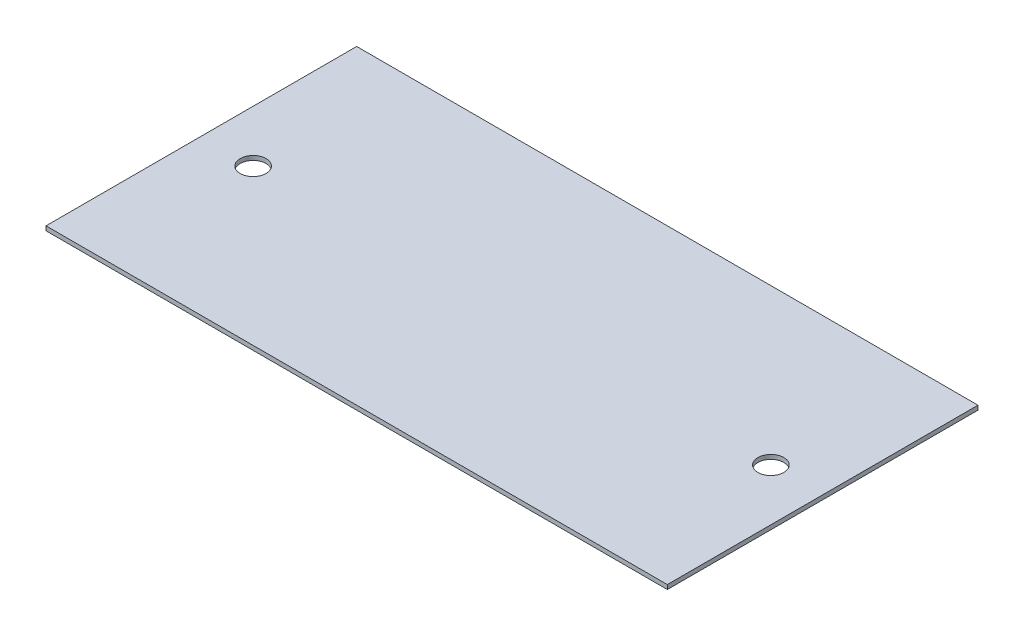
ISO-10303-21;
HEADER;
FILE_DESCRIPTION(('STEP AP214'),'2;1');
FILE_NAME('part.step','',(''),(''),'','','');
FILE_SCHEMA(('AUTOMOTIVE_DESIGN { 1 0 10303 214 1 1 1 1 }'));
ENDSEC;
DATA;
#1=APPLICATION_CONTEXT('core data for automotive mechanical design processes');
#2=APPLICATION_PROTOCOL_DEFINITION('international standard','automotive_design',2000,#1);
#3=PRODUCT_CONTEXT('',#1,'mechanical');
#4=PRODUCT('Part','Part','',(#3));
#5=PRODUCT_RELATED_PRODUCT_CATEGORY('part','',(#4));
#6=PRODUCT_DEFINITION_FORMATION('','',#4);
#7=PRODUCT_DEFINITION_CONTEXT('part definition',#1,'design');
#8=PRODUCT_DEFINITION('design','',#6,#7);
#9=PRODUCT_DEFINITION_SHAPE('','',#8);
#10=(LENGTH_UNIT() NAMED_UNIT(*) SI_UNIT(.MILLI.,.METRE.));
#11=(NAMED_UNIT(*) PLANE_ANGLE_UNIT() SI_UNIT($,.RADIAN.));
#12=(NAMED_UNIT(*) SI_UNIT($,.STERADIAN.) SOLID_ANGLE_UNIT());
#13=UNCERTAINTY_MEASURE_WITH_UNIT(LENGTH_MEASURE(1.E-05),#10,'distance_accuracy_value','');
#14=(GEOMETRIC_REPRESENTATION_CONTEXT(3) GLOBAL_UNCERTAINTY_ASSIGNED_CONTEXT((#13)) GLOBAL_UNIT_ASSIGNED_CONTEXT((#10,
#11,#12)) REPRESENTATION_CONTEXT('',''));
#15=CARTESIAN_POINT('',(0.,0.,0.));
#16=DIRECTION('',(0.,0.,1.));
#17=DIRECTION('',(1.,0.,0.));
#18=AXIS2_PLACEMENT_3D('',#15,#16,#17);
#19=CARTESIAN_POINT('',(914.4,6.35,0.));
#20=DIRECTION('',(-1.,0.,0.));
#21=DIRECTION('',(0.,0.,1.));
#22=AXIS2_PLACEMENT_3D('',#19,#20,#21);
#23=PLANE('',#22);
#24=DIRECTION('',(0.,0.,-1.));
#25=VECTOR('',#24,1.);
#26=CARTESIAN_POINT('',(914.4,0.,0.));
#27=LINE('',#26,#25);
#28=CARTESIAN_POINT('',(914.4,0.,0.));
#29=VERTEX_POINT('',#28);
#30=CARTESIAN_POINT('',(914.4,0.,-457.2));
#31=VERTEX_POINT('',#30);
#32=EDGE_CURVE('E96',#29,#31,#27,.T.);
#33=ORIENTED_EDGE('',*,*,#32,.T.);
#34=DIRECTION('',(0.,-1.,0.));
#35=VECTOR('',#34,1.);
#36=CARTESIAN_POINT('',(914.4,6.35,-457.2));
#37=LINE('',#36,#35);
#38=CARTESIAN_POINT('',(914.4,6.35,-457.2));
#39=VERTEX_POINT('',#38);
#40=EDGE_CURVE('E11',#39,#31,#37,.T.);
#41=ORIENTED_EDGE('',*,*,#40,.F.);
#42=DIRECTION('',(0.,0.,-1.));
#43=VECTOR('',#42,1.);
#44=CARTESIAN_POINT('',(914.4,6.35,0.));
#45=LINE('',#44,#43);
#46=CARTESIAN_POINT('',(914.4,6.35,0.));
#47=VERTEX_POINT('',#46);
#48=EDGE_CURVE('E84',#47,#39,#45,.T.);
#49=ORIENTED_EDGE('',*,*,#48,.F.);
#50=DIRECTION('',(0.,-1.,0.));
#51=VECTOR('',#50,1.);
#52=CARTESIAN_POINT('',(914.4,6.35,0.));
#53=LINE('',#52,#51);
#54=EDGE_CURVE('E92',#47,#29,#53,.T.);
#55=ORIENTED_EDGE('',*,*,#54,.T.);
#56=EDGE_LOOP('',(#33,#41,#49,#55));
#57=FACE_BOUND('',#56,.T.);
#58=ADVANCED_FACE('F33',(#57),#23,.F.);
#59=CARTESIAN_POINT('',(0.,6.35,-457.2));
#60=DIRECTION('',(0.,0.,1.));
#61=DIRECTION('',(1.,0.,0.));
#62=AXIS2_PLACEMENT_3D('',#59,#60,#61);
#63=PLANE('',#62);
#64=DIRECTION('',(-1.,0.,0.));
#65=VECTOR('',#64,1.);
#66=CARTESIAN_POINT('',(0.,0.,-457.2));
#67=LINE('',#66,#65);
#68=CARTESIAN_POINT('',(0.,0.,-457.2));
#69=VERTEX_POINT('',#68);
#70=EDGE_CURVE('E88',#31,#69,#67,.T.);
#71=ORIENTED_EDGE('',*,*,#70,.T.);
#72=DIRECTION('',(0.,-1.,0.));
#73=VECTOR('',#72,1.);
#74=CARTESIAN_POINT('',(0.,6.35,-457.2));
#75=LINE('',#74,#73);
#76=CARTESIAN_POINT('',(0.,6.35,-457.2));
#77=VERTEX_POINT('',#76);
#78=EDGE_CURVE('E41',#77,#69,#75,.T.);
#79=ORIENTED_EDGE('',*,*,#78,.F.);
#80=DIRECTION('',(-1.,0.,0.));
#81=VECTOR('',#80,1.);
#82=CARTESIAN_POINT('',(0.,6.35,-457.2));
#83=LINE('',#82,#81);
#84=EDGE_CURVE('E79',#39,#77,#83,.T.);
#85=ORIENTED_EDGE('',*,*,#84,.F.);
#86=ORIENTED_EDGE('',*,*,#40,.T.);
#87=EDGE_LOOP('',(#71,#79,#85,#86));
#88=FACE_BOUND('',#87,.T.);
#89=ADVANCED_FACE('F87',(#88),#63,.F.);
#90=CARTESIAN_POINT('',(0.,6.35,0.));
#91=DIRECTION('',(1.,0.,0.));
#92=DIRECTION('',(0.,0.,-1.));
#93=AXIS2_PLACEMENT_3D('',#90,#91,#92);
#94=PLANE('',#93);
#95=DIRECTION('',(0.,0.,1.));
#96=VECTOR('',#95,1.);
#97=CARTESIAN_POINT('',(0.,0.,0.));
#98=LINE('',#97,#96);
#99=CARTESIAN_POINT('',(0.,0.,0.));
#100=VERTEX_POINT('',#99);
#101=EDGE_CURVE('E66',#69,#100,#98,.T.);
#102=ORIENTED_EDGE('',*,*,#101,.T.);
#103=DIRECTION('',(0.,-1.,0.));
#104=VECTOR('',#103,1.);
#105=CARTESIAN_POINT('',(0.,6.35,0.));
#106=LINE('',#105,#104);
#107=CARTESIAN_POINT('',(0.,6.35,0.));
#108=VERTEX_POINT('',#107);
#109=EDGE_CURVE('E89',#108,#100,#106,.T.);
#110=ORIENTED_EDGE('',*,*,#109,.F.);
#111=DIRECTION('',(0.,0.,1.));
#112=VECTOR('',#111,1.);
#113=CARTESIAN_POINT('',(0.,6.35,0.));
#114=LINE('',#113,#112);
#115=EDGE_CURVE('E82',#77,#108,#114,.T.);
#116=ORIENTED_EDGE('',*,*,#115,.F.);
#117=ORIENTED_EDGE('',*,*,#78,.T.);
#118=EDGE_LOOP('',(#102,#110,#116,#117));
#119=FACE_BOUND('',#118,.T.);
#120=ADVANCED_FACE('F90',(#119),#94,.F.);
#121=CARTESIAN_POINT('',(0.,6.35,0.));
#122=DIRECTION('',(0.,0.,-1.));
#123=DIRECTION('',(-1.,0.,0.));
#124=AXIS2_PLACEMENT_3D('',#121,#122,#123);
#125=PLANE('',#124);
#126=DIRECTION('',(1.,0.,0.));
#127=VECTOR('',#126,1.);
#128=CARTESIAN_POINT('',(0.,0.,0.));
#129=LINE('',#128,#127);
#130=EDGE_CURVE('E72',#100,#29,#129,.T.);
#131=ORIENTED_EDGE('',*,*,#130,.T.);
#132=ORIENTED_EDGE('',*,*,#54,.F.);
#133=DIRECTION('',(1.,0.,0.));
#134=VECTOR('',#133,1.);
#135=CARTESIAN_POINT('',(0.,6.35,0.));
#136=LINE('',#135,#134);
#137=EDGE_CURVE('E49',#108,#47,#136,.T.);
#138=ORIENTED_EDGE('',*,*,#137,.F.);
#139=ORIENTED_EDGE('',*,*,#109,.T.);
#140=EDGE_LOOP('',(#131,#132,#138,#139));
#141=FACE_BOUND('',#140,.T.);
#142=ADVANCED_FACE('F104',(#141),#125,.F.);
#143=CARTESIAN_POINT('',(0.,6.35,0.));
#144=DIRECTION('',(0.,-1.,0.));
#145=DIRECTION('',(0.,0.,-1.));
#146=AXIS2_PLACEMENT_3D('',#143,#144,#145);
#147=PLANE('',#146);
#148=CARTESIAN_POINT('',(838.2,6.35,-228.6));
#149=DIRECTION('',(0.,1.,0.));
#150=DIRECTION('',(0.,0.,-1.));
#151=AXIS2_PLACEMENT_3D('',#148,#149,#150);
#152=CIRCLE('',#151,19.05);
#153=CARTESIAN_POINT('',(838.2,6.35,-247.65));
#154=VERTEX_POINT('',#153);
#155=EDGE_CURVE('E116',#154,#154,#152,.T.);
#156=ORIENTED_EDGE('',*,*,#155,.F.);
#157=EDGE_LOOP('',(#156));
#158=FACE_BOUND('',#157,.T.);
#159=CARTESIAN_POINT('',(76.2,6.35,-228.6));
#160=DIRECTION('',(0.,1.,0.));
#161=DIRECTION('',(0.,0.,1.));
#162=AXIS2_PLACEMENT_3D('',#159,#160,#161);
#163=CIRCLE('',#162,19.05);
#164=CARTESIAN_POINT('',(76.2,6.35,-209.55));
#165=VERTEX_POINT('',#164);
#166=EDGE_CURVE('E110',#165,#165,#163,.T.);
#167=ORIENTED_EDGE('',*,*,#166,.F.);
#168=EDGE_LOOP('',(#167));
#169=FACE_BOUND('',#168,.T.);
#170=ORIENTED_EDGE('',*,*,#48,.T.);
#171=ORIENTED_EDGE('',*,*,#84,.T.);
#172=ORIENTED_EDGE('',*,*,#115,.T.);
#173=ORIENTED_EDGE('',*,*,#137,.T.);
#174=EDGE_LOOP('',(#170,#171,#172,#173));
#175=FACE_BOUND('',#174,.T.);
#176=ADVANCED_FACE('F80',(#158,#169,#175),#147,.F.);
#177=CARTESIAN_POINT('',(0.,0.,0.));
#178=DIRECTION('',(0.,-1.,0.));
#179=DIRECTION('',(0.,0.,-1.));
#180=AXIS2_PLACEMENT_3D('',#177,#178,#179);
#181=PLANE('',#180);
#182=CARTESIAN_POINT('',(838.2,0.,-228.6));
#183=DIRECTION('',(0.,1.,0.));
#184=DIRECTION('',(0.,0.,-1.));
#185=AXIS2_PLACEMENT_3D('',#182,#183,#184);
#186=CIRCLE('',#185,19.05);
#187=CARTESIAN_POINT('',(838.2,0.,-247.65));
#188=VERTEX_POINT('',#187);
#189=EDGE_CURVE('E113',#188,#188,#186,.T.);
#190=ORIENTED_EDGE('',*,*,#189,.T.);
#191=EDGE_LOOP('',(#190));
#192=FACE_BOUND('',#191,.T.);
#193=CARTESIAN_POINT('',(76.2,0.,-228.6));
#194=DIRECTION('',(0.,1.,0.));
#195=DIRECTION('',(0.,0.,1.));
#196=AXIS2_PLACEMENT_3D('',#193,#194,#195);
#197=CIRCLE('',#196,19.05);
#198=CARTESIAN_POINT('',(76.2,0.,-209.55));
#199=VERTEX_POINT('',#198);
#200=EDGE_CURVE('E99',#199,#199,#197,.T.);
#201=ORIENTED_EDGE('',*,*,#200,.T.);
#202=EDGE_LOOP('',(#201));
#203=FACE_BOUND('',#202,.T.);
#204=ORIENTED_EDGE('',*,*,#32,.F.);
#205=ORIENTED_EDGE('',*,*,#130,.F.);
#206=ORIENTED_EDGE('',*,*,#101,.F.);
#207=ORIENTED_EDGE('',*,*,#70,.F.);
#208=EDGE_LOOP('',(#204,#205,#206,#207));
#209=FACE_BOUND('',#208,.T.);
#210=ADVANCED_FACE('F107',(#192,#203,#209),#181,.T.);
#211=CARTESIAN_POINT('',(76.2,0.,-228.6));
#212=DIRECTION('',(0.,1.,0.));
#213=DIRECTION('',(0.,0.,1.));
#214=AXIS2_PLACEMENT_3D('',#211,#212,#213);
#215=CYLINDRICAL_SURFACE('',#214,19.05);
#216=ORIENTED_EDGE('',*,*,#200,.F.);
#217=EDGE_LOOP('',(#216));
#218=FACE_BOUND('',#217,.T.);
#219=ORIENTED_EDGE('',*,*,#166,.T.);
#220=EDGE_LOOP('',(#219));
#221=FACE_BOUND('',#220,.T.);
#222=ADVANCED_FACE('F127',(#218,#221),#215,.F.);
#223=CARTESIAN_POINT('',(838.2,0.,-228.6));
#224=DIRECTION('',(0.,1.,0.));
#225=DIRECTION('',(0.,0.,1.));
#226=AXIS2_PLACEMENT_3D('',#223,#224,#225);
#227=CYLINDRICAL_SURFACE('',#226,19.05);
#228=ORIENTED_EDGE('',*,*,#189,.F.);
#229=EDGE_LOOP('',(#228));
#230=FACE_BOUND('',#229,.T.);
#231=ORIENTED_EDGE('',*,*,#155,.T.);
#232=EDGE_LOOP('',(#231));
#233=FACE_BOUND('',#232,.T.);
#234=ADVANCED_FACE('F124',(#230,#233),#227,.F.);
#235=CLOSED_SHELL('',(#58,#89,#120,#142,#176,#210,#222,#234));
#236=MANIFOLD_SOLID_BREP('B2',#235);
#237=ADVANCED_BREP_SHAPE_REPRESENTATION('',(#18,#236),#14);
#238=SHAPE_DEFINITION_REPRESENTATION(#9,#237);
ENDSEC;
END-ISO-10303-21;
